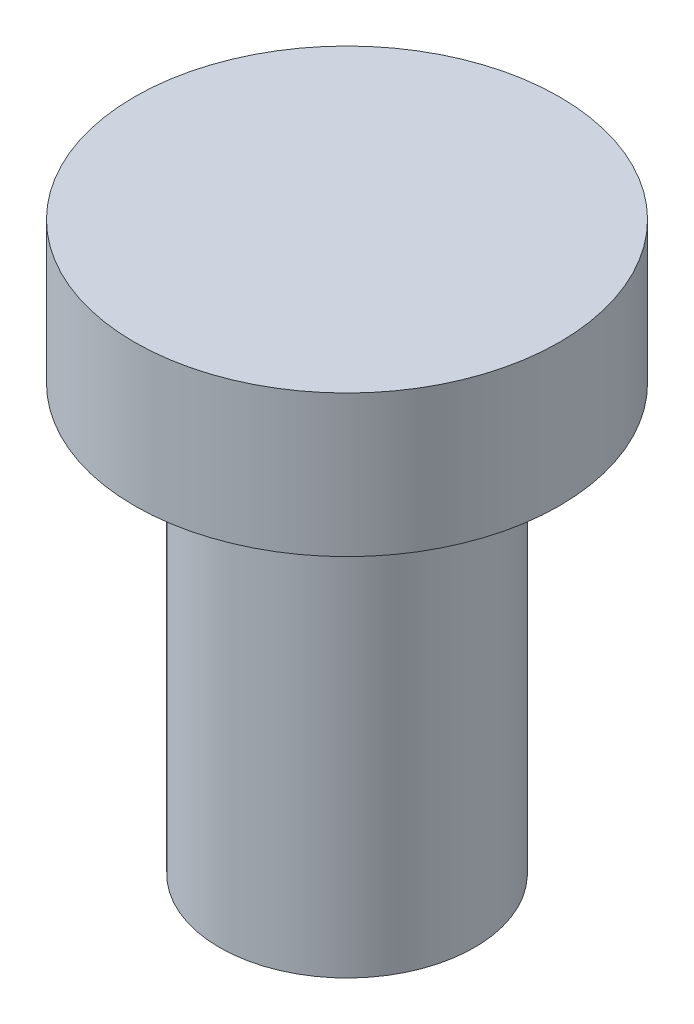
ISO-10303-21;
HEADER;
FILE_DESCRIPTION(('STEP AP214'),'2;1');
FILE_NAME('part.step','',(''),(''),'','','');
FILE_SCHEMA(('AUTOMOTIVE_DESIGN { 1 0 10303 214 1 1 1 1 }'));
ENDSEC;
DATA;
#1=APPLICATION_CONTEXT('core data for automotive mechanical design processes');
#2=APPLICATION_PROTOCOL_DEFINITION('international standard','automotive_design',2000,#1);
#3=PRODUCT_CONTEXT('',#1,'mechanical');
#4=PRODUCT('Part','Part','',(#3));
#5=PRODUCT_RELATED_PRODUCT_CATEGORY('part','',(#4));
#6=PRODUCT_DEFINITION_FORMATION('','',#4);
#7=PRODUCT_DEFINITION_CONTEXT('part definition',#1,'design');
#8=PRODUCT_DEFINITION('design','',#6,#7);
#9=PRODUCT_DEFINITION_SHAPE('','',#8);
#10=(LENGTH_UNIT() NAMED_UNIT(*) SI_UNIT(.MILLI.,.METRE.));
#11=(NAMED_UNIT(*) PLANE_ANGLE_UNIT() SI_UNIT($,.RADIAN.));
#12=(NAMED_UNIT(*) SI_UNIT($,.STERADIAN.) SOLID_ANGLE_UNIT());
#13=UNCERTAINTY_MEASURE_WITH_UNIT(LENGTH_MEASURE(1.E-05),#10,'distance_accuracy_value','');
#14=(GEOMETRIC_REPRESENTATION_CONTEXT(3) GLOBAL_UNCERTAINTY_ASSIGNED_CONTEXT((#13)) GLOBAL_UNIT_ASSIGNED_CONTEXT((#10,
#11,#12)) REPRESENTATION_CONTEXT('',''));
#15=CARTESIAN_POINT('',(0.,0.,0.));
#16=DIRECTION('',(0.,0.,1.));
#17=DIRECTION('',(1.,0.,0.));
#18=AXIS2_PLACEMENT_3D('',#15,#16,#17);
#19=CARTESIAN_POINT('',(0.,-6.,0.));
#20=DIRECTION('',(0.,1.,0.));
#21=DIRECTION('',(0.,0.,1.));
#22=AXIS2_PLACEMENT_3D('',#19,#20,#21);
#23=CYLINDRICAL_SURFACE('',#22,1.8);
#24=CARTESIAN_POINT('',(0.,-6.,0.));
#25=DIRECTION('',(0.,1.,0.));
#26=DIRECTION('',(0.,0.,1.));
#27=AXIS2_PLACEMENT_3D('',#24,#25,#26);
#28=CIRCLE('',#27,1.8);
#29=CARTESIAN_POINT('',(0.,-6.,1.8));
#30=VERTEX_POINT('',#29);
#31=EDGE_CURVE('E10',#30,#30,#28,.T.);
#32=ORIENTED_EDGE('',*,*,#31,.T.);
#33=EDGE_LOOP('',(#32));
#34=FACE_BOUND('',#33,.T.);
#35=CARTESIAN_POINT('',(0.,0.,0.));
#36=DIRECTION('',(0.,1.,0.));
#37=DIRECTION('',(0.,0.,1.));
#38=AXIS2_PLACEMENT_3D('',#35,#36,#37);
#39=CIRCLE('',#38,1.8);
#40=CARTESIAN_POINT('',(0.,0.,1.8));
#41=VERTEX_POINT('',#40);
#42=EDGE_CURVE('E38',#41,#41,#39,.T.);
#43=ORIENTED_EDGE('',*,*,#42,.F.);
#44=EDGE_LOOP('',(#43));
#45=FACE_BOUND('',#44,.T.);
#46=ADVANCED_FACE('F35',(#34,#45),#23,.T.);
#47=CARTESIAN_POINT('',(0.,-6.,0.));
#48=DIRECTION('',(0.,1.,0.));
#49=DIRECTION('',(0.,0.,1.));
#50=AXIS2_PLACEMENT_3D('',#47,#48,#49);
#51=PLANE('',#50);
#52=ORIENTED_EDGE('',*,*,#31,.F.);
#53=EDGE_LOOP('',(#52));
#54=FACE_BOUND('',#53,.T.);
#55=ADVANCED_FACE('F58',(#54),#51,.F.);
#56=CARTESIAN_POINT('',(0.,2.,0.));
#57=DIRECTION('',(0.,-1.,0.));
#58=DIRECTION('',(0.,0.,-1.));
#59=AXIS2_PLACEMENT_3D('',#56,#57,#58);
#60=CYLINDRICAL_SURFACE('',#59,3.);
#61=CARTESIAN_POINT('',(0.,2.,0.));
#62=DIRECTION('',(0.,1.,0.));
#63=DIRECTION('',(0.,0.,1.));
#64=AXIS2_PLACEMENT_3D('',#61,#62,#63);
#65=CIRCLE('',#64,3.);
#66=CARTESIAN_POINT('',(0.,2.,3.));
#67=VERTEX_POINT('',#66);
#68=EDGE_CURVE('E45',#67,#67,#65,.T.);
#69=ORIENTED_EDGE('',*,*,#68,.F.);
#70=EDGE_LOOP('',(#69));
#71=FACE_BOUND('',#70,.T.);
#72=CARTESIAN_POINT('',(0.,0.,0.));
#73=DIRECTION('',(0.,1.,0.));
#74=DIRECTION('',(0.,0.,1.));
#75=AXIS2_PLACEMENT_3D('',#72,#73,#74);
#76=CIRCLE('',#75,3.);
#77=CARTESIAN_POINT('',(0.,0.,3.));
#78=VERTEX_POINT('',#77);
#79=EDGE_CURVE('E47',#78,#78,#76,.T.);
#80=ORIENTED_EDGE('',*,*,#79,.T.);
#81=EDGE_LOOP('',(#80));
#82=FACE_BOUND('',#81,.T.);
#83=ADVANCED_FACE('F55',(#71,#82),#60,.T.);
#84=CARTESIAN_POINT('',(0.,2.,0.));
#85=DIRECTION('',(0.,1.,0.));
#86=DIRECTION('',(0.,0.,1.));
#87=AXIS2_PLACEMENT_3D('',#84,#85,#86);
#88=PLANE('',#87);
#89=ORIENTED_EDGE('',*,*,#68,.T.);
#90=EDGE_LOOP('',(#89));
#91=FACE_BOUND('',#90,.T.);
#92=ADVANCED_FACE('F53',(#91),#88,.T.);
#93=CARTESIAN_POINT('',(0.,0.,0.));
#94=DIRECTION('',(0.,1.,0.));
#95=DIRECTION('',(0.,0.,1.));
#96=AXIS2_PLACEMENT_3D('',#93,#94,#95);
#97=PLANE('',#96);
#98=ORIENTED_EDGE('',*,*,#42,.T.);
#99=EDGE_LOOP('',(#98));
#100=FACE_BOUND('',#99,.T.);
#101=ORIENTED_EDGE('',*,*,#79,.F.);
#102=EDGE_LOOP('',(#101));
#103=FACE_BOUND('',#102,.T.);
#104=ADVANCED_FACE('F62',(#100,#103),#97,.F.);
#105=CLOSED_SHELL('',(#46,#55,#83,#92,#104));
#106=MANIFOLD_SOLID_BREP('B2',#105);
#107=ADVANCED_BREP_SHAPE_REPRESENTATION('',(#18,#106),#14);
#108=SHAPE_DEFINITION_REPRESENTATION(#9,#107);
ENDSEC;
END-ISO-10303-21;
